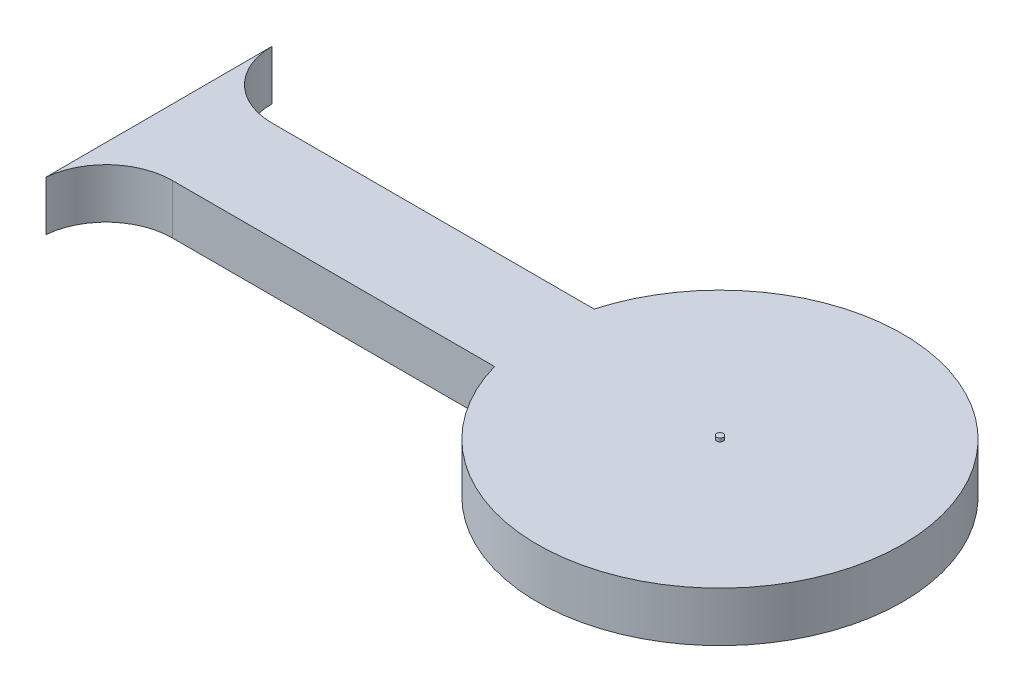
ISO-10303-21;
HEADER;
FILE_DESCRIPTION(('STEP AP214'),'2;1');
FILE_NAME('part.step','',(''),(''),'','','');
FILE_SCHEMA(('AUTOMOTIVE_DESIGN { 1 0 10303 214 1 1 1 1 }'));
ENDSEC;
DATA;
#1=APPLICATION_CONTEXT('core data for automotive mechanical design processes');
#2=APPLICATION_PROTOCOL_DEFINITION('international standard','automotive_design',2000,#1);
#3=PRODUCT_CONTEXT('',#1,'mechanical');
#4=PRODUCT('Part','Part','',(#3));
#5=PRODUCT_RELATED_PRODUCT_CATEGORY('part','',(#4));
#6=PRODUCT_DEFINITION_FORMATION('','',#4);
#7=PRODUCT_DEFINITION_CONTEXT('part definition',#1,'design');
#8=PRODUCT_DEFINITION('design','',#6,#7);
#9=PRODUCT_DEFINITION_SHAPE('','',#8);
#10=(LENGTH_UNIT() NAMED_UNIT(*) SI_UNIT(.MILLI.,.METRE.));
#11=(NAMED_UNIT(*) PLANE_ANGLE_UNIT() SI_UNIT($,.RADIAN.));
#12=(NAMED_UNIT(*) SI_UNIT($,.STERADIAN.) SOLID_ANGLE_UNIT());
#13=UNCERTAINTY_MEASURE_WITH_UNIT(LENGTH_MEASURE(1.E-05),#10,'distance_accuracy_value','');
#14=(GEOMETRIC_REPRESENTATION_CONTEXT(3) GLOBAL_UNCERTAINTY_ASSIGNED_CONTEXT((#13)) GLOBAL_UNIT_ASSIGNED_CONTEXT((#10,
#11,#12)) REPRESENTATION_CONTEXT('',''));
#15=CARTESIAN_POINT('',(0.,0.,0.));
#16=DIRECTION('',(0.,0.,1.));
#17=DIRECTION('',(1.,0.,0.));
#18=AXIS2_PLACEMENT_3D('',#15,#16,#17);
#19=CARTESIAN_POINT('',(0.,1.5,2.));
#20=DIRECTION('',(0.,1.,0.));
#21=DIRECTION('',(0.,0.,1.));
#22=AXIS2_PLACEMENT_3D('',#19,#20,#21);
#23=PLANE('',#22);
#24=CARTESIAN_POINT('',(0.,1.5,2.));
#25=DIRECTION('',(0.,-1.,0.));
#26=DIRECTION('',(0.,0.,1.));
#27=AXIS2_PLACEMENT_3D('',#24,#25,#26);
#28=CIRCLE('',#27,2.);
#29=CARTESIAN_POINT('',(-1.99156988331715,1.5,1.81656227251702));
#30=VERTEX_POINT('',#29);
#31=CARTESIAN_POINT('',(0.,1.5,0.));
#32=VERTEX_POINT('',#31);
#33=EDGE_CURVE('E134',#30,#32,#28,.T.);
#34=ORIENTED_EDGE('',*,*,#33,.T.);
#35=DIRECTION('',(1.,0.,0.));
#36=VECTOR('',#35,1.);
#37=CARTESIAN_POINT('',(0.,1.5,0.));
#38=LINE('',#37,#36);
#39=CARTESIAN_POINT('',(9.70849737787082,1.5,0.));
#40=VERTEX_POINT('',#39);
#41=EDGE_CURVE('E92',#32,#40,#38,.T.);
#42=ORIENTED_EDGE('',*,*,#41,.T.);
#43=CARTESIAN_POINT('',(15.,1.5,-1.5));
#44=DIRECTION('',(0.,1.,0.));
#45=DIRECTION('',(0.,0.,-1.));
#46=AXIS2_PLACEMENT_3D('',#43,#44,#45);
#47=CIRCLE('',#46,5.5);
#48=CARTESIAN_POINT('',(9.70849737787082,1.5,-3.));
#49=VERTEX_POINT('',#48);
#50=EDGE_CURVE('E105',#40,#49,#47,.T.);
#51=ORIENTED_EDGE('',*,*,#50,.T.);
#52=DIRECTION('',(-1.,0.,0.));
#53=VECTOR('',#52,1.);
#54=CARTESIAN_POINT('',(0.,1.5,-3.));
#55=LINE('',#54,#53);
#56=CARTESIAN_POINT('',(0.,1.5,-3.));
#57=VERTEX_POINT('',#56);
#58=EDGE_CURVE('E99',#49,#57,#55,.T.);
#59=ORIENTED_EDGE('',*,*,#58,.T.);
#60=CARTESIAN_POINT('',(0.,1.5,-5.));
#61=DIRECTION('',(0.,-1.,0.));
#62=DIRECTION('',(0.,0.,1.));
#63=AXIS2_PLACEMENT_3D('',#60,#61,#62);
#64=CIRCLE('',#63,2.);
#65=CARTESIAN_POINT('',(-2.,1.5,-5.));
#66=VERTEX_POINT('',#65);
#67=EDGE_CURVE('E103',#57,#66,#64,.T.);
#68=ORIENTED_EDGE('',*,*,#67,.T.);
#69=DIRECTION('',(0.00123670992783422,0.,0.999999235273985));
#70=VECTOR('',#69,1.);
#71=CARTESIAN_POINT('',(-2.,1.5,-5.));
#72=LINE('',#71,#70);
#73=EDGE_CURVE('E55',#66,#30,#72,.T.);
#74=ORIENTED_EDGE('',*,*,#73,.T.);
#75=EDGE_LOOP('',(#34,#42,#51,#59,#68,#74));
#76=FACE_BOUND('',#75,.T.);
#77=CARTESIAN_POINT('',(15.,1.5,-1.5));
#78=DIRECTION('',(0.,1.,0.));
#79=DIRECTION('',(0.,0.,1.));
#80=AXIS2_PLACEMENT_3D('',#77,#78,#79);
#81=CIRCLE('',#80,0.0999999999999994);
#82=CARTESIAN_POINT('',(15.,1.5,-1.4));
#83=VERTEX_POINT('',#82);
#84=EDGE_CURVE('E174',#83,#83,#81,.T.);
#85=ORIENTED_EDGE('',*,*,#84,.F.);
#86=EDGE_LOOP('',(#85));
#87=FACE_BOUND('',#86,.T.);
#88=ADVANCED_FACE('F38',(#76,#87),#23,.T.);
#89=CARTESIAN_POINT('',(0.,1.5,2.));
#90=DIRECTION('',(0.,-1.,0.));
#91=DIRECTION('',(0.,0.,-1.));
#92=AXIS2_PLACEMENT_3D('',#89,#90,#91);
#93=CYLINDRICAL_SURFACE('',#92,2.);
#94=CARTESIAN_POINT('',(0.,0.,2.));
#95=DIRECTION('',(0.,-1.,0.));
#96=DIRECTION('',(0.,0.,1.));
#97=AXIS2_PLACEMENT_3D('',#94,#95,#96);
#98=CIRCLE('',#97,2.);
#99=CARTESIAN_POINT('',(-1.99156988331715,0.,1.81656227251702));
#100=VERTEX_POINT('',#99);
#101=CARTESIAN_POINT('',(0.,0.,0.));
#102=VERTEX_POINT('',#101);
#103=EDGE_CURVE('E123',#100,#102,#98,.T.);
#104=ORIENTED_EDGE('',*,*,#103,.T.);
#105=DIRECTION('',(0.,-1.,0.));
#106=VECTOR('',#105,1.);
#107=CARTESIAN_POINT('',(0.,1.5,0.));
#108=LINE('',#107,#106);
#109=EDGE_CURVE('E11',#32,#102,#108,.T.);
#110=ORIENTED_EDGE('',*,*,#109,.F.);
#111=ORIENTED_EDGE('',*,*,#33,.F.);
#112=DIRECTION('',(0.,-1.,0.));
#113=VECTOR('',#112,1.);
#114=CARTESIAN_POINT('',(-1.99156988331715,1.5,1.81656227251702));
#115=LINE('',#114,#113);
#116=EDGE_CURVE('E119',#30,#100,#115,.T.);
#117=ORIENTED_EDGE('',*,*,#116,.T.);
#118=EDGE_LOOP('',(#104,#110,#111,#117));
#119=FACE_BOUND('',#118,.T.);
#120=ADVANCED_FACE('F40',(#119),#93,.F.);
#121=CARTESIAN_POINT('',(0.,1.5,0.));
#122=DIRECTION('',(0.,0.,-1.));
#123=DIRECTION('',(-1.,0.,0.));
#124=AXIS2_PLACEMENT_3D('',#121,#122,#123);
#125=PLANE('',#124);
#126=DIRECTION('',(1.,0.,0.));
#127=VECTOR('',#126,1.);
#128=CARTESIAN_POINT('',(0.,0.,0.));
#129=LINE('',#128,#127);
#130=CARTESIAN_POINT('',(9.70849737787082,0.,0.));
#131=VERTEX_POINT('',#130);
#132=EDGE_CURVE('E126',#102,#131,#129,.T.);
#133=ORIENTED_EDGE('',*,*,#132,.T.);
#134=DIRECTION('',(0.,-1.,0.));
#135=VECTOR('',#134,1.);
#136=CARTESIAN_POINT('',(9.70849737787082,1.5,0.));
#137=LINE('',#136,#135);
#138=EDGE_CURVE('E47',#40,#131,#137,.T.);
#139=ORIENTED_EDGE('',*,*,#138,.F.);
#140=ORIENTED_EDGE('',*,*,#41,.F.);
#141=ORIENTED_EDGE('',*,*,#109,.T.);
#142=EDGE_LOOP('',(#133,#139,#140,#141));
#143=FACE_BOUND('',#142,.T.);
#144=ADVANCED_FACE('F162',(#143),#125,.F.);
#145=CARTESIAN_POINT('',(15.,1.5,-1.5));
#146=DIRECTION('',(0.,-1.,0.));
#147=DIRECTION('',(0.,0.,-1.));
#148=AXIS2_PLACEMENT_3D('',#145,#146,#147);
#149=CYLINDRICAL_SURFACE('',#148,5.5);
#150=CARTESIAN_POINT('',(15.,0.,-1.5));
#151=DIRECTION('',(0.,1.,0.));
#152=DIRECTION('',(0.,0.,-1.));
#153=AXIS2_PLACEMENT_3D('',#150,#151,#152);
#154=CIRCLE('',#153,5.5);
#155=CARTESIAN_POINT('',(9.70849737787082,0.,-3.));
#156=VERTEX_POINT('',#155);
#157=EDGE_CURVE('E129',#131,#156,#154,.T.);
#158=ORIENTED_EDGE('',*,*,#157,.T.);
#159=DIRECTION('',(0.,-1.,0.));
#160=VECTOR('',#159,1.);
#161=CARTESIAN_POINT('',(9.70849737787082,1.5,-3.));
#162=LINE('',#161,#160);
#163=EDGE_CURVE('E114',#49,#156,#162,.T.);
#164=ORIENTED_EDGE('',*,*,#163,.F.);
#165=ORIENTED_EDGE('',*,*,#50,.F.);
#166=ORIENTED_EDGE('',*,*,#138,.T.);
#167=EDGE_LOOP('',(#158,#164,#165,#166));
#168=FACE_BOUND('',#167,.T.);
#169=ADVANCED_FACE('F140',(#168),#149,.T.);
#170=CARTESIAN_POINT('',(0.,1.5,-3.));
#171=DIRECTION('',(0.,0.,1.));
#172=DIRECTION('',(1.,0.,0.));
#173=AXIS2_PLACEMENT_3D('',#170,#171,#172);
#174=PLANE('',#173);
#175=DIRECTION('',(-1.,0.,0.));
#176=VECTOR('',#175,1.);
#177=CARTESIAN_POINT('',(0.,0.,-3.));
#178=LINE('',#177,#176);
#179=CARTESIAN_POINT('',(0.,0.,-3.));
#180=VERTEX_POINT('',#179);
#181=EDGE_CURVE('E113',#156,#180,#178,.T.);
#182=ORIENTED_EDGE('',*,*,#181,.T.);
#183=DIRECTION('',(0.,-1.,0.));
#184=VECTOR('',#183,1.);
#185=CARTESIAN_POINT('',(0.,1.5,-3.));
#186=LINE('',#185,#184);
#187=EDGE_CURVE('E110',#57,#180,#186,.T.);
#188=ORIENTED_EDGE('',*,*,#187,.F.);
#189=ORIENTED_EDGE('',*,*,#58,.F.);
#190=ORIENTED_EDGE('',*,*,#163,.T.);
#191=EDGE_LOOP('',(#182,#188,#189,#190));
#192=FACE_BOUND('',#191,.T.);
#193=ADVANCED_FACE('F111',(#192),#174,.F.);
#194=CARTESIAN_POINT('',(0.,1.5,-5.));
#195=DIRECTION('',(0.,-1.,0.));
#196=DIRECTION('',(0.,0.,-1.));
#197=AXIS2_PLACEMENT_3D('',#194,#195,#196);
#198=CYLINDRICAL_SURFACE('',#197,2.);
#199=CARTESIAN_POINT('',(0.,0.,-5.));
#200=DIRECTION('',(0.,-1.,0.));
#201=DIRECTION('',(0.,0.,1.));
#202=AXIS2_PLACEMENT_3D('',#199,#200,#201);
#203=CIRCLE('',#202,2.);
#204=CARTESIAN_POINT('',(-2.,0.,-5.));
#205=VERTEX_POINT('',#204);
#206=EDGE_CURVE('E78',#180,#205,#203,.T.);
#207=ORIENTED_EDGE('',*,*,#206,.T.);
#208=DIRECTION('',(0.,-1.,0.));
#209=VECTOR('',#208,1.);
#210=CARTESIAN_POINT('',(-2.,1.5,-5.));
#211=LINE('',#210,#209);
#212=EDGE_CURVE('E115',#66,#205,#211,.T.);
#213=ORIENTED_EDGE('',*,*,#212,.F.);
#214=ORIENTED_EDGE('',*,*,#67,.F.);
#215=ORIENTED_EDGE('',*,*,#187,.T.);
#216=EDGE_LOOP('',(#207,#213,#214,#215));
#217=FACE_BOUND('',#216,.T.);
#218=ADVANCED_FACE('F117',(#217),#198,.F.);
#219=CARTESIAN_POINT('',(-2.,1.5,-5.));
#220=DIRECTION('',(0.999999235273985,0.,-0.00123670992783422));
#221=DIRECTION('',(-0.00123670992783422,0.,-0.999999235273985));
#222=AXIS2_PLACEMENT_3D('',#219,#220,#221);
#223=PLANE('',#222);
#224=DIRECTION('',(0.00123670992783422,0.,0.999999235273985));
#225=VECTOR('',#224,1.);
#226=CARTESIAN_POINT('',(-2.,0.,-5.));
#227=LINE('',#226,#225);
#228=EDGE_CURVE('E84',#205,#100,#227,.T.);
#229=ORIENTED_EDGE('',*,*,#228,.T.);
#230=ORIENTED_EDGE('',*,*,#116,.F.);
#231=ORIENTED_EDGE('',*,*,#73,.F.);
#232=ORIENTED_EDGE('',*,*,#212,.T.);
#233=EDGE_LOOP('',(#229,#230,#231,#232));
#234=FACE_BOUND('',#233,.T.);
#235=ADVANCED_FACE('F147',(#234),#223,.F.);
#236=CARTESIAN_POINT('',(0.,0.,2.));
#237=DIRECTION('',(0.,1.,0.));
#238=DIRECTION('',(0.,0.,1.));
#239=AXIS2_PLACEMENT_3D('',#236,#237,#238);
#240=PLANE('',#239);
#241=ORIENTED_EDGE('',*,*,#103,.F.);
#242=ORIENTED_EDGE('',*,*,#228,.F.);
#243=ORIENTED_EDGE('',*,*,#206,.F.);
#244=ORIENTED_EDGE('',*,*,#181,.F.);
#245=ORIENTED_EDGE('',*,*,#157,.F.);
#246=ORIENTED_EDGE('',*,*,#132,.F.);
#247=EDGE_LOOP('',(#241,#242,#243,#244,#245,#246));
#248=FACE_BOUND('',#247,.T.);
#249=ADVANCED_FACE('F143',(#248),#240,.F.);
#250=CARTESIAN_POINT('',(15.,1.6,-1.5));
#251=DIRECTION('',(0.,-1.,0.));
#252=DIRECTION('',(0.,0.,-1.));
#253=AXIS2_PLACEMENT_3D('',#250,#251,#252);
#254=CYLINDRICAL_SURFACE('',#253,0.0999999999999994);
#255=CARTESIAN_POINT('',(15.,1.6,-1.5));
#256=DIRECTION('',(0.,1.,0.));
#257=DIRECTION('',(0.,0.,1.));
#258=AXIS2_PLACEMENT_3D('',#255,#256,#257);
#259=CIRCLE('',#258,0.0999999999999994);
#260=CARTESIAN_POINT('',(15.,1.6,-1.4));
#261=VERTEX_POINT('',#260);
#262=EDGE_CURVE('E127',#261,#261,#259,.T.);
#263=ORIENTED_EDGE('',*,*,#262,.F.);
#264=EDGE_LOOP('',(#263));
#265=FACE_BOUND('',#264,.T.);
#266=ORIENTED_EDGE('',*,*,#84,.T.);
#267=EDGE_LOOP('',(#266));
#268=FACE_BOUND('',#267,.T.);
#269=ADVANCED_FACE('F154',(#265,#268),#254,.T.);
#270=CARTESIAN_POINT('',(15.,1.6,-1.5));
#271=DIRECTION('',(0.,1.,0.));
#272=DIRECTION('',(0.,0.,1.));
#273=AXIS2_PLACEMENT_3D('',#270,#271,#272);
#274=PLANE('',#273);
#275=ORIENTED_EDGE('',*,*,#262,.T.);
#276=EDGE_LOOP('',(#275));
#277=FACE_BOUND('',#276,.T.);
#278=ADVANCED_FACE('F166',(#277),#274,.T.);
#279=CLOSED_SHELL('',(#88,#120,#144,#169,#193,#218,#235,#249,#269,#278));
#280=MANIFOLD_SOLID_BREP('B2',#279);
#281=ADVANCED_BREP_SHAPE_REPRESENTATION('',(#18,#280),#14);
#282=SHAPE_DEFINITION_REPRESENTATION(#9,#281);
ENDSEC;
END-ISO-10303-21;
